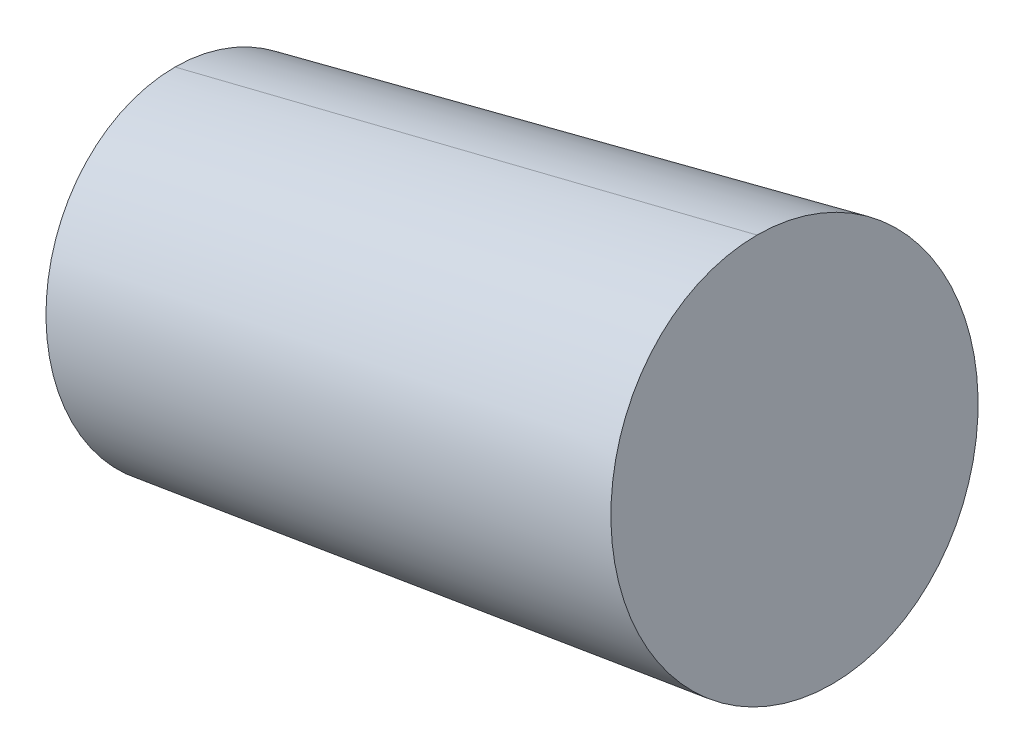
ISO-10303-21;
HEADER;
FILE_DESCRIPTION(('STEP AP214'),'2;1');
FILE_NAME('part.step','',(''),(''),'','','');
FILE_SCHEMA(('AUTOMOTIVE_DESIGN { 1 0 10303 214 1 1 1 1 }'));
ENDSEC;
DATA;
#1=APPLICATION_CONTEXT('core data for automotive mechanical design processes');
#2=APPLICATION_PROTOCOL_DEFINITION('international standard','automotive_design',2000,#1);
#3=PRODUCT_CONTEXT('',#1,'mechanical');
#4=PRODUCT('Part','Part','',(#3));
#5=PRODUCT_RELATED_PRODUCT_CATEGORY('part','',(#4));
#6=PRODUCT_DEFINITION_FORMATION('','',#4);
#7=PRODUCT_DEFINITION_CONTEXT('part definition',#1,'design');
#8=PRODUCT_DEFINITION('design','',#6,#7);
#9=PRODUCT_DEFINITION_SHAPE('','',#8);
#10=(LENGTH_UNIT() NAMED_UNIT(*) SI_UNIT(.MILLI.,.METRE.));
#11=(NAMED_UNIT(*) PLANE_ANGLE_UNIT() SI_UNIT($,.RADIAN.));
#12=(NAMED_UNIT(*) SI_UNIT($,.STERADIAN.) SOLID_ANGLE_UNIT());
#13=UNCERTAINTY_MEASURE_WITH_UNIT(LENGTH_MEASURE(1.E-05),#10,'distance_accuracy_value','');
#14=(GEOMETRIC_REPRESENTATION_CONTEXT(3) GLOBAL_UNCERTAINTY_ASSIGNED_CONTEXT((#13)) GLOBAL_UNIT_ASSIGNED_CONTEXT((#10,
#11,#12)) REPRESENTATION_CONTEXT('',''));
#15=CARTESIAN_POINT('',(0.,0.,0.));
#16=DIRECTION('',(0.,0.,1.));
#17=DIRECTION('',(1.,0.,0.));
#18=AXIS2_PLACEMENT_3D('',#15,#16,#17);
#19=CARTESIAN_POINT('',(18.5435800357601,28.610419099746,0.));
#20=DIRECTION('',(-0.978038604349684,-0.208423819180347,0.));
#21=DIRECTION('',(0.208423819180347,-0.978038604349684,0.));
#22=AXIS2_PLACEMENT_3D('',#19,#20,#21);
#23=PLANE('',#22);
#24=CARTESIAN_POINT('',(18.5435800357601,28.610419099746,0.));
#25=DIRECTION('',(-0.978038604349684,-0.208423819180347,0.));
#26=DIRECTION('',(0.208423819180347,-0.978038604349684,0.));
#27=AXIS2_PLACEMENT_3D('',#24,#25,#26);
#28=CIRCLE('',#27,4.75732814706715);
#29=CARTESIAN_POINT('',(17.5520395342542,33.263269681137,0.));
#30=VERTEX_POINT('',#29);
#31=CARTESIAN_POINT('',(19.535120537266,23.957568518355,0.));
#32=VERTEX_POINT('',#31);
#33=EDGE_CURVE('E11',#30,#32,#28,.T.);
#34=ORIENTED_EDGE('',*,*,#33,.F.);
#35=CARTESIAN_POINT('',(18.5435800357601,28.610419099746,0.));
#36=DIRECTION('',(-0.978038604349684,-0.208423819180347,0.));
#37=DIRECTION('',(0.208423819180347,-0.978038604349684,0.));
#38=AXIS2_PLACEMENT_3D('',#35,#36,#37);
#39=CIRCLE('',#38,4.75732814706715);
#40=EDGE_CURVE('E25',#32,#30,#39,.T.);
#41=ORIENTED_EDGE('',*,*,#40,.F.);
#42=EDGE_LOOP('',(#34,#41));
#43=FACE_BOUND('',#42,.T.);
#44=ADVANCED_FACE('F17',(#43),#23,.F.);
#45=CARTESIAN_POINT('',(18.5435800357601,28.610419099746,0.));
#46=DIRECTION('',(0.978038604349684,0.208423819180347,0.));
#47=DIRECTION('',(0.,0.,-1.));
#48=AXIS2_PLACEMENT_3D('',#45,#46,#47);
#49=CONICAL_SURFACE('',#48,4.75732814706715,0.0350113047949867);
#50=DIRECTION('',(0.984734929038765,0.17406067772768,0.));
#51=VECTOR('',#50,1.);
#52=CARTESIAN_POINT('',(3.8979340937361,21.193556407226,0.));
#53=LINE('',#52,#51);
#54=CARTESIAN_POINT('',(3.8979340937361,21.193556407226,0.));
#55=VERTEX_POINT('',#54);
#56=EDGE_CURVE('E43',#55,#32,#53,.T.);
#57=ORIENTED_EDGE('',*,*,#56,.T.);
#58=ORIENTED_EDGE('',*,*,#40,.T.);
#59=DIRECTION('',(0.970143530747324,0.242531502591139,0.));
#60=VECTOR('',#59,1.);
#61=CARTESIAN_POINT('',(2.14655850588388,29.411968978166,0.));
#62=LINE('',#61,#60);
#63=CARTESIAN_POINT('',(2.14655850588388,29.411968978166,0.));
#64=VERTEX_POINT('',#63);
#65=EDGE_CURVE('E45',#64,#30,#62,.T.);
#66=ORIENTED_EDGE('',*,*,#65,.F.);
#67=CARTESIAN_POINT('',(3.02224629980999,25.302762692696,0.));
#68=DIRECTION('',(-0.978038604349684,-0.208423819180347,0.));
#69=DIRECTION('',(0.208423819180347,-0.978038604349684,0.));
#70=AXIS2_PLACEMENT_3D('',#67,#68,#69);
#71=CIRCLE('',#70,4.20147657484574);
#72=EDGE_CURVE('E40',#55,#64,#71,.T.);
#73=ORIENTED_EDGE('',*,*,#72,.F.);
#74=EDGE_LOOP('',(#57,#58,#66,#73));
#75=FACE_BOUND('',#74,.T.);
#76=ADVANCED_FACE('F42',(#75),#49,.T.);
#77=CARTESIAN_POINT('',(3.89793409373606,21.193556407226,0.));
#78=DIRECTION('',(0.978038604349684,0.208423819180347,0.));
#79=DIRECTION('',(-0.208423819180347,0.978038604349684,0.));
#80=AXIS2_PLACEMENT_3D('',#77,#78,#79);
#81=PLANE('',#80);
#82=ORIENTED_EDGE('',*,*,#72,.T.);
#83=CARTESIAN_POINT('',(3.02224629980999,25.302762692696,0.));
#84=DIRECTION('',(-0.978038604349684,-0.208423819180347,0.));
#85=DIRECTION('',(0.208423819180347,-0.978038604349684,0.));
#86=AXIS2_PLACEMENT_3D('',#83,#84,#85);
#87=CIRCLE('',#86,4.20147657484574);
#88=EDGE_CURVE('E49',#64,#55,#87,.T.);
#89=ORIENTED_EDGE('',*,*,#88,.T.);
#90=EDGE_LOOP('',(#82,#89));
#91=FACE_BOUND('',#90,.T.);
#92=ADVANCED_FACE('F54',(#91),#81,.F.);
#93=CARTESIAN_POINT('',(18.5435800357601,28.610419099746,0.));
#94=DIRECTION('',(0.978038604349684,0.208423819180347,0.));
#95=DIRECTION('',(0.,0.,1.));
#96=AXIS2_PLACEMENT_3D('',#93,#94,#95);
#97=CONICAL_SURFACE('',#96,4.75732814706715,0.0350113047949867);
#98=ORIENTED_EDGE('',*,*,#56,.F.);
#99=ORIENTED_EDGE('',*,*,#88,.F.);
#100=ORIENTED_EDGE('',*,*,#65,.T.);
#101=ORIENTED_EDGE('',*,*,#33,.T.);
#102=EDGE_LOOP('',(#98,#99,#100,#101));
#103=FACE_BOUND('',#102,.T.);
#104=ADVANCED_FACE('F52',(#103),#97,.T.);
#105=CLOSED_SHELL('',(#44,#76,#92,#104));
#106=MANIFOLD_SOLID_BREP('B1',#105);
#107=ADVANCED_BREP_SHAPE_REPRESENTATION('',(#18,#106),#14);
#108=SHAPE_DEFINITION_REPRESENTATION(#9,#107);
ENDSEC;
END-ISO-10303-21;
